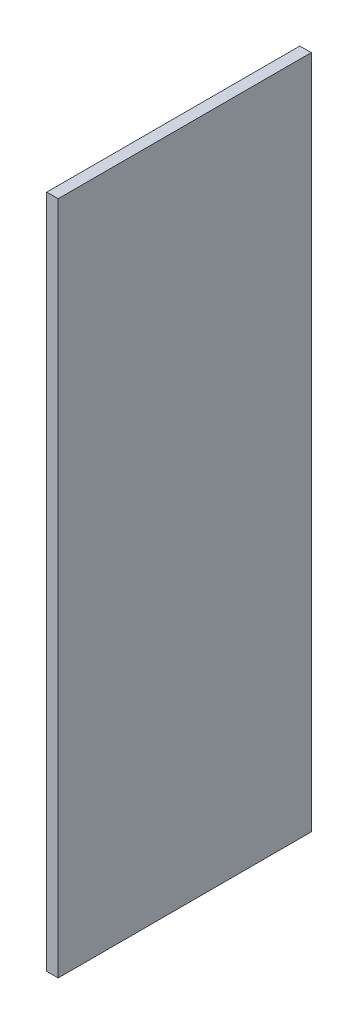
ISO-10303-21;
HEADER;
FILE_DESCRIPTION(('STEP AP214'),'2;1');
FILE_NAME('part.step','',(''),(''),'','','');
FILE_SCHEMA(('AUTOMOTIVE_DESIGN { 1 0 10303 214 1 1 1 1 }'));
ENDSEC;
DATA;
#1=APPLICATION_CONTEXT('core data for automotive mechanical design processes');
#2=APPLICATION_PROTOCOL_DEFINITION('international standard','automotive_design',2000,#1);
#3=PRODUCT_CONTEXT('',#1,'mechanical');
#4=PRODUCT('Part','Part','',(#3));
#5=PRODUCT_RELATED_PRODUCT_CATEGORY('part','',(#4));
#6=PRODUCT_DEFINITION_FORMATION('','',#4);
#7=PRODUCT_DEFINITION_CONTEXT('part definition',#1,'design');
#8=PRODUCT_DEFINITION('design','',#6,#7);
#9=PRODUCT_DEFINITION_SHAPE('','',#8);
#10=(LENGTH_UNIT() NAMED_UNIT(*) SI_UNIT(.MILLI.,.METRE.));
#11=(NAMED_UNIT(*) PLANE_ANGLE_UNIT() SI_UNIT($,.RADIAN.));
#12=(NAMED_UNIT(*) SI_UNIT($,.STERADIAN.) SOLID_ANGLE_UNIT());
#13=UNCERTAINTY_MEASURE_WITH_UNIT(LENGTH_MEASURE(1.E-05),#10,'distance_accuracy_value','');
#14=(GEOMETRIC_REPRESENTATION_CONTEXT(3) GLOBAL_UNCERTAINTY_ASSIGNED_CONTEXT((#13)) GLOBAL_UNIT_ASSIGNED_CONTEXT((#10,
#11,#12)) REPRESENTATION_CONTEXT('',''));
#15=CARTESIAN_POINT('',(0.,0.,0.));
#16=DIRECTION('',(0.,0.,1.));
#17=DIRECTION('',(1.,0.,0.));
#18=AXIS2_PLACEMENT_3D('',#15,#16,#17);
#19=CARTESIAN_POINT('',(-0.1016,-6.0000007,4.50000116));
#20=DIRECTION('',(0.,0.,1.));
#21=DIRECTION('',(1.,0.,0.));
#22=AXIS2_PLACEMENT_3D('',#19,#20,#21);
#23=PLANE('',#22);
#24=DIRECTION('',(0.,1.,0.));
#25=VECTOR('',#24,1.);
#26=CARTESIAN_POINT('',(-0.1016,-6.0000007,4.50000116));
#27=LINE('',#26,#25);
#28=CARTESIAN_POINT('',(-0.1016,-6.0000007,4.50000116));
#29=VERTEX_POINT('',#28);
#30=CARTESIAN_POINT('',(-0.1016,6.0000007,4.50000116));
#31=VERTEX_POINT('',#30);
#32=EDGE_CURVE('E106',#29,#31,#27,.T.);
#33=ORIENTED_EDGE('',*,*,#32,.F.);
#34=DIRECTION('',(-1.,0.,0.));
#35=VECTOR('',#34,1.);
#36=CARTESIAN_POINT('',(0.1016,-6.0000007,4.50000116));
#37=LINE('',#36,#35);
#38=CARTESIAN_POINT('',(0.1016,-6.0000007,4.50000116));
#39=VERTEX_POINT('',#38);
#40=EDGE_CURVE('E28',#39,#29,#37,.T.);
#41=ORIENTED_EDGE('',*,*,#40,.F.);
#42=DIRECTION('',(0.,-1.,0.));
#43=VECTOR('',#42,1.);
#44=CARTESIAN_POINT('',(0.1016,6.0000007,4.50000116));
#45=LINE('',#44,#43);
#46=CARTESIAN_POINT('',(0.1016,6.0000007,4.50000116));
#47=VERTEX_POINT('',#46);
#48=EDGE_CURVE('E78',#47,#39,#45,.T.);
#49=ORIENTED_EDGE('',*,*,#48,.F.);
#50=DIRECTION('',(1.,0.,0.));
#51=VECTOR('',#50,1.);
#52=CARTESIAN_POINT('',(-0.1016,6.0000007,4.50000116));
#53=LINE('',#52,#51);
#54=EDGE_CURVE('E21',#31,#47,#53,.T.);
#55=ORIENTED_EDGE('',*,*,#54,.F.);
#56=EDGE_LOOP('',(#33,#41,#49,#55));
#57=FACE_BOUND('',#56,.T.);
#58=ADVANCED_FACE('F17',(#57),#23,.T.);
#59=CARTESIAN_POINT('',(-0.1016,-6.0000007,0.));
#60=DIRECTION('',(0.,0.,1.));
#61=DIRECTION('',(1.,0.,0.));
#62=AXIS2_PLACEMENT_3D('',#59,#60,#61);
#63=PLANE('',#62);
#64=DIRECTION('',(0.,1.,0.));
#65=VECTOR('',#64,1.);
#66=CARTESIAN_POINT('',(-0.1016,-6.0000007,0.));
#67=LINE('',#66,#65);
#68=CARTESIAN_POINT('',(-0.1016,-6.0000007,0.));
#69=VERTEX_POINT('',#68);
#70=CARTESIAN_POINT('',(-0.1016,6.0000007,0.));
#71=VERTEX_POINT('',#70);
#72=EDGE_CURVE('E94',#69,#71,#67,.T.);
#73=ORIENTED_EDGE('',*,*,#72,.T.);
#74=DIRECTION('',(1.,0.,0.));
#75=VECTOR('',#74,1.);
#76=CARTESIAN_POINT('',(-0.1016,6.0000007,0.));
#77=LINE('',#76,#75);
#78=CARTESIAN_POINT('',(0.1016,6.0000007,0.));
#79=VERTEX_POINT('',#78);
#80=EDGE_CURVE('E81',#71,#79,#77,.T.);
#81=ORIENTED_EDGE('',*,*,#80,.T.);
#82=DIRECTION('',(0.,-1.,0.));
#83=VECTOR('',#82,1.);
#84=CARTESIAN_POINT('',(0.1016,6.0000007,0.));
#85=LINE('',#84,#83);
#86=CARTESIAN_POINT('',(0.1016,-6.0000007,0.));
#87=VERTEX_POINT('',#86);
#88=EDGE_CURVE('E73',#79,#87,#85,.T.);
#89=ORIENTED_EDGE('',*,*,#88,.T.);
#90=DIRECTION('',(-1.,0.,0.));
#91=VECTOR('',#90,1.);
#92=CARTESIAN_POINT('',(0.1016,-6.0000007,0.));
#93=LINE('',#92,#91);
#94=EDGE_CURVE('E11',#87,#69,#93,.T.);
#95=ORIENTED_EDGE('',*,*,#94,.T.);
#96=EDGE_LOOP('',(#73,#81,#89,#95));
#97=FACE_BOUND('',#96,.T.);
#98=ADVANCED_FACE('F121',(#97),#63,.F.);
#99=CARTESIAN_POINT('',(0.1016,-6.0000007,0.));
#100=DIRECTION('',(0.,-1.,0.));
#101=DIRECTION('',(0.,0.,-1.));
#102=AXIS2_PLACEMENT_3D('',#99,#100,#101);
#103=PLANE('',#102);
#104=DIRECTION('',(0.,0.,1.));
#105=VECTOR('',#104,1.);
#106=CARTESIAN_POINT('',(0.1016,-6.0000007,0.));
#107=LINE('',#106,#105);
#108=EDGE_CURVE('E80',#87,#39,#107,.T.);
#109=ORIENTED_EDGE('',*,*,#108,.T.);
#110=ORIENTED_EDGE('',*,*,#40,.T.);
#111=DIRECTION('',(0.,0.,1.));
#112=VECTOR('',#111,1.);
#113=CARTESIAN_POINT('',(-0.1016,-6.0000007,0.));
#114=LINE('',#113,#112);
#115=EDGE_CURVE('E109',#69,#29,#114,.T.);
#116=ORIENTED_EDGE('',*,*,#115,.F.);
#117=ORIENTED_EDGE('',*,*,#94,.F.);
#118=EDGE_LOOP('',(#109,#110,#116,#117));
#119=FACE_BOUND('',#118,.T.);
#120=ADVANCED_FACE('F19',(#119),#103,.T.);
#121=CARTESIAN_POINT('',(0.1016,6.0000007,0.));
#122=DIRECTION('',(1.,0.,0.));
#123=DIRECTION('',(0.,1.,0.));
#124=AXIS2_PLACEMENT_3D('',#121,#122,#123);
#125=PLANE('',#124);
#126=DIRECTION('',(0.,0.,1.));
#127=VECTOR('',#126,1.);
#128=CARTESIAN_POINT('',(0.1016,6.0000007,0.));
#129=LINE('',#128,#127);
#130=EDGE_CURVE('E84',#79,#47,#129,.T.);
#131=ORIENTED_EDGE('',*,*,#130,.T.);
#132=ORIENTED_EDGE('',*,*,#48,.T.);
#133=ORIENTED_EDGE('',*,*,#108,.F.);
#134=ORIENTED_EDGE('',*,*,#88,.F.);
#135=EDGE_LOOP('',(#131,#132,#133,#134));
#136=FACE_BOUND('',#135,.T.);
#137=ADVANCED_FACE('F85',(#136),#125,.T.);
#138=CARTESIAN_POINT('',(-0.1016,6.0000007,0.));
#139=DIRECTION('',(0.,1.,0.));
#140=DIRECTION('',(1.,0.,0.));
#141=AXIS2_PLACEMENT_3D('',#138,#139,#140);
#142=PLANE('',#141);
#143=DIRECTION('',(0.,0.,1.));
#144=VECTOR('',#143,1.);
#145=CARTESIAN_POINT('',(-0.1016,6.0000007,0.));
#146=LINE('',#145,#144);
#147=EDGE_CURVE('E91',#71,#31,#146,.T.);
#148=ORIENTED_EDGE('',*,*,#147,.T.);
#149=ORIENTED_EDGE('',*,*,#54,.T.);
#150=ORIENTED_EDGE('',*,*,#130,.F.);
#151=ORIENTED_EDGE('',*,*,#80,.F.);
#152=EDGE_LOOP('',(#148,#149,#150,#151));
#153=FACE_BOUND('',#152,.T.);
#154=ADVANCED_FACE('F89',(#153),#142,.T.);
#155=CARTESIAN_POINT('',(-0.1016,-6.0000007,0.));
#156=DIRECTION('',(-1.,0.,0.));
#157=DIRECTION('',(0.,0.,1.));
#158=AXIS2_PLACEMENT_3D('',#155,#156,#157);
#159=PLANE('',#158);
#160=ORIENTED_EDGE('',*,*,#115,.T.);
#161=ORIENTED_EDGE('',*,*,#32,.T.);
#162=ORIENTED_EDGE('',*,*,#147,.F.);
#163=ORIENTED_EDGE('',*,*,#72,.F.);
#164=EDGE_LOOP('',(#160,#161,#162,#163));
#165=FACE_BOUND('',#164,.T.);
#166=ADVANCED_FACE('F119',(#165),#159,.T.);
#167=CLOSED_SHELL('',(#58,#98,#120,#137,#154,#166));
#168=MANIFOLD_SOLID_BREP('B1',#167);
#169=ADVANCED_BREP_SHAPE_REPRESENTATION('',(#18,#168),#14);
#170=SHAPE_DEFINITION_REPRESENTATION(#9,#169);
ENDSEC;
END-ISO-10303-21;
